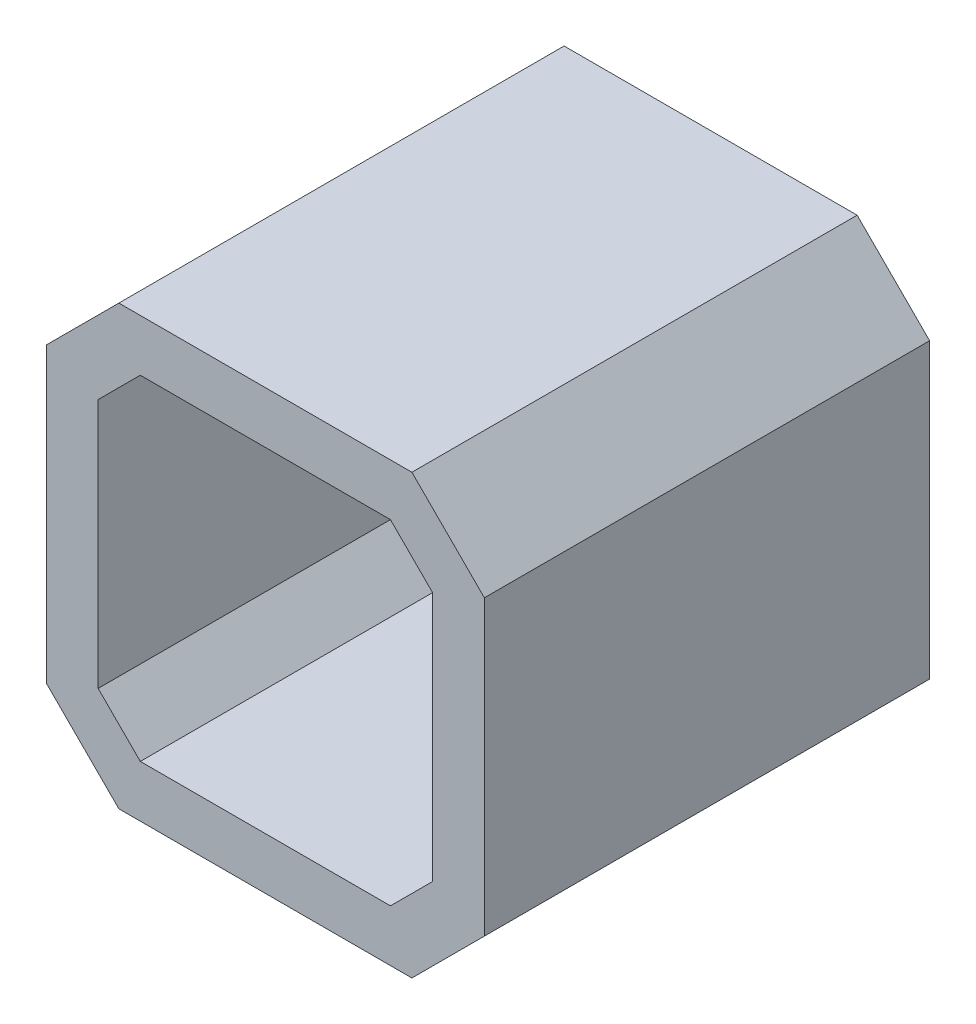
ISO-10303-21;
HEADER;
FILE_DESCRIPTION(('STEP AP214'),'2;1');
FILE_NAME('part.step','',(''),(''),'','','');
FILE_SCHEMA(('AUTOMOTIVE_DESIGN { 1 0 10303 214 1 1 1 1 }'));
ENDSEC;
DATA;
#1=APPLICATION_CONTEXT('core data for automotive mechanical design processes');
#2=APPLICATION_PROTOCOL_DEFINITION('international standard','automotive_design',2000,#1);
#3=PRODUCT_CONTEXT('',#1,'mechanical');
#4=PRODUCT('Part','Part','',(#3));
#5=PRODUCT_RELATED_PRODUCT_CATEGORY('part','',(#4));
#6=PRODUCT_DEFINITION_FORMATION('','',#4);
#7=PRODUCT_DEFINITION_CONTEXT('part definition',#1,'design');
#8=PRODUCT_DEFINITION('design','',#6,#7);
#9=PRODUCT_DEFINITION_SHAPE('','',#8);
#10=(LENGTH_UNIT() NAMED_UNIT(*) SI_UNIT(.MILLI.,.METRE.));
#11=(NAMED_UNIT(*) PLANE_ANGLE_UNIT() SI_UNIT($,.RADIAN.));
#12=(NAMED_UNIT(*) SI_UNIT($,.STERADIAN.) SOLID_ANGLE_UNIT());
#13=UNCERTAINTY_MEASURE_WITH_UNIT(LENGTH_MEASURE(1.E-05),#10,'distance_accuracy_value','');
#14=(GEOMETRIC_REPRESENTATION_CONTEXT(3) GLOBAL_UNCERTAINTY_ASSIGNED_CONTEXT((#13)) GLOBAL_UNIT_ASSIGNED_CONTEXT((#10,
#11,#12)) REPRESENTATION_CONTEXT('',''));
#15=CARTESIAN_POINT('',(0.,0.,0.));
#16=DIRECTION('',(0.,0.,1.));
#17=DIRECTION('',(1.,0.,0.));
#18=AXIS2_PLACEMENT_3D('',#15,#16,#17);
#19=CARTESIAN_POINT('',(0.,0.,43.));
#20=DIRECTION('',(0.,0.,-1.));
#21=DIRECTION('',(-1.,0.,0.));
#22=AXIS2_PLACEMENT_3D('',#19,#20,#21);
#23=PLANE('',#22);
#24=DIRECTION('',(0.,-1.,0.));
#25=VECTOR('',#24,1.);
#26=CARTESIAN_POINT('',(-21.15,-14.15,43.));
#27=LINE('',#26,#25);
#28=CARTESIAN_POINT('',(-21.15,14.15,43.));
#29=VERTEX_POINT('',#28);
#30=CARTESIAN_POINT('',(-21.15,-14.15,43.));
#31=VERTEX_POINT('',#30);
#32=EDGE_CURVE('E211',#29,#31,#27,.T.);
#33=ORIENTED_EDGE('',*,*,#32,.T.);
#34=DIRECTION('',(0.707106781186547,-0.707106781186547,0.));
#35=VECTOR('',#34,1.);
#36=CARTESIAN_POINT('',(-21.15,-14.15,43.));
#37=LINE('',#36,#35);
#38=CARTESIAN_POINT('',(-14.15,-21.15,43.));
#39=VERTEX_POINT('',#38);
#40=EDGE_CURVE('E214',#31,#39,#37,.T.);
#41=ORIENTED_EDGE('',*,*,#40,.T.);
#42=DIRECTION('',(1.,0.,0.));
#43=VECTOR('',#42,1.);
#44=CARTESIAN_POINT('',(-14.15,-21.15,43.));
#45=LINE('',#44,#43);
#46=CARTESIAN_POINT('',(14.15,-21.15,43.));
#47=VERTEX_POINT('',#46);
#48=EDGE_CURVE('E217',#39,#47,#45,.T.);
#49=ORIENTED_EDGE('',*,*,#48,.T.);
#50=DIRECTION('',(0.707106781186547,0.707106781186547,0.));
#51=VECTOR('',#50,1.);
#52=CARTESIAN_POINT('',(14.15,-21.15,43.));
#53=LINE('',#52,#51);
#54=CARTESIAN_POINT('',(21.15,-14.15,43.));
#55=VERTEX_POINT('',#54);
#56=EDGE_CURVE('E219',#47,#55,#53,.T.);
#57=ORIENTED_EDGE('',*,*,#56,.T.);
#58=DIRECTION('',(0.,1.,0.));
#59=VECTOR('',#58,1.);
#60=CARTESIAN_POINT('',(21.15,-14.15,43.));
#61=LINE('',#60,#59);
#62=CARTESIAN_POINT('',(21.15,14.15,43.));
#63=VERTEX_POINT('',#62);
#64=EDGE_CURVE('E221',#55,#63,#61,.T.);
#65=ORIENTED_EDGE('',*,*,#64,.T.);
#66=DIRECTION('',(-0.707106781186547,0.707106781186547,0.));
#67=VECTOR('',#66,1.);
#68=CARTESIAN_POINT('',(14.15,21.15,43.));
#69=LINE('',#68,#67);
#70=CARTESIAN_POINT('',(14.15,21.15,43.));
#71=VERTEX_POINT('',#70);
#72=EDGE_CURVE('E223',#63,#71,#69,.T.);
#73=ORIENTED_EDGE('',*,*,#72,.T.);
#74=DIRECTION('',(-1.,0.,0.));
#75=VECTOR('',#74,1.);
#76=CARTESIAN_POINT('',(-14.15,21.15,43.));
#77=LINE('',#76,#75);
#78=CARTESIAN_POINT('',(-14.15,21.15,43.));
#79=VERTEX_POINT('',#78);
#80=EDGE_CURVE('E225',#71,#79,#77,.T.);
#81=ORIENTED_EDGE('',*,*,#80,.T.);
#82=DIRECTION('',(-0.707106781186547,-0.707106781186547,0.));
#83=VECTOR('',#82,1.);
#84=CARTESIAN_POINT('',(-21.15,14.15,43.));
#85=LINE('',#84,#83);
#86=EDGE_CURVE('E227',#79,#29,#85,.T.);
#87=ORIENTED_EDGE('',*,*,#86,.T.);
#88=EDGE_LOOP('',(#33,#41,#49,#57,#65,#73,#81,#87));
#89=FACE_BOUND('',#88,.T.);
#90=DIRECTION('',(-0.707106781186547,-0.707106781186547,0.));
#91=VECTOR('',#90,1.);
#92=CARTESIAN_POINT('',(-16.15,12.0789321881345,43.));
#93=LINE('',#92,#91);
#94=CARTESIAN_POINT('',(-12.0789321881345,16.15,43.));
#95=VERTEX_POINT('',#94);
#96=CARTESIAN_POINT('',(-16.15,12.0789321881345,43.));
#97=VERTEX_POINT('',#96);
#98=EDGE_CURVE('E146',#95,#97,#93,.T.);
#99=ORIENTED_EDGE('',*,*,#98,.F.);
#100=DIRECTION('',(-1.,0.,0.));
#101=VECTOR('',#100,1.);
#102=CARTESIAN_POINT('',(-12.0789321881345,16.15,43.));
#103=LINE('',#102,#101);
#104=CARTESIAN_POINT('',(12.0789321881345,16.15,43.));
#105=VERTEX_POINT('',#104);
#106=EDGE_CURVE('E179',#105,#95,#103,.T.);
#107=ORIENTED_EDGE('',*,*,#106,.F.);
#108=DIRECTION('',(-0.707106781186547,0.707106781186547,0.));
#109=VECTOR('',#108,1.);
#110=CARTESIAN_POINT('',(12.0789321881345,16.15,43.));
#111=LINE('',#110,#109);
#112=CARTESIAN_POINT('',(16.15,12.0789321881345,43.));
#113=VERTEX_POINT('',#112);
#114=EDGE_CURVE('E177',#113,#105,#111,.T.);
#115=ORIENTED_EDGE('',*,*,#114,.F.);
#116=DIRECTION('',(0.,1.,0.));
#117=VECTOR('',#116,1.);
#118=CARTESIAN_POINT('',(16.15,-12.0789321881345,43.));
#119=LINE('',#118,#117);
#120=CARTESIAN_POINT('',(16.15,-12.0789321881345,43.));
#121=VERTEX_POINT('',#120);
#122=EDGE_CURVE('E175',#121,#113,#119,.T.);
#123=ORIENTED_EDGE('',*,*,#122,.F.);
#124=DIRECTION('',(0.707106781186547,0.707106781186547,0.));
#125=VECTOR('',#124,1.);
#126=CARTESIAN_POINT('',(12.0789321881345,-16.15,43.));
#127=LINE('',#126,#125);
#128=CARTESIAN_POINT('',(12.0789321881345,-16.15,43.));
#129=VERTEX_POINT('',#128);
#130=EDGE_CURVE('E173',#129,#121,#127,.T.);
#131=ORIENTED_EDGE('',*,*,#130,.F.);
#132=DIRECTION('',(1.,0.,0.));
#133=VECTOR('',#132,1.);
#134=CARTESIAN_POINT('',(-12.0789321881345,-16.15,43.));
#135=LINE('',#134,#133);
#136=CARTESIAN_POINT('',(-12.0789321881345,-16.15,43.));
#137=VERTEX_POINT('',#136);
#138=EDGE_CURVE('E169',#137,#129,#135,.T.);
#139=ORIENTED_EDGE('',*,*,#138,.F.);
#140=DIRECTION('',(0.707106781186547,-0.707106781186547,0.));
#141=VECTOR('',#140,1.);
#142=CARTESIAN_POINT('',(-16.15,-12.0789321881345,43.));
#143=LINE('',#142,#141);
#144=CARTESIAN_POINT('',(-16.15,-12.0789321881345,43.));
#145=VERTEX_POINT('',#144);
#146=EDGE_CURVE('E167',#145,#137,#143,.T.);
#147=ORIENTED_EDGE('',*,*,#146,.F.);
#148=DIRECTION('',(0.,-1.,0.));
#149=VECTOR('',#148,1.);
#150=CARTESIAN_POINT('',(-16.15,-12.0789321881345,43.));
#151=LINE('',#150,#149);
#152=EDGE_CURVE('E154',#97,#145,#151,.T.);
#153=ORIENTED_EDGE('',*,*,#152,.F.);
#154=EDGE_LOOP('',(#99,#107,#115,#123,#131,#139,#147,#153));
#155=FACE_BOUND('',#154,.T.);
#156=ADVANCED_FACE('F33',(#89,#155),#23,.F.);
#157=CARTESIAN_POINT('',(0.,0.,0.));
#158=DIRECTION('',(0.,0.,-1.));
#159=DIRECTION('',(-1.,0.,0.));
#160=AXIS2_PLACEMENT_3D('',#157,#158,#159);
#161=PLANE('',#160);
#162=DIRECTION('',(0.,-1.,0.));
#163=VECTOR('',#162,1.);
#164=CARTESIAN_POINT('',(-21.15,-14.15,0.));
#165=LINE('',#164,#163);
#166=CARTESIAN_POINT('',(-21.15,14.15,0.));
#167=VERTEX_POINT('',#166);
#168=CARTESIAN_POINT('',(-21.15,-14.15,0.));
#169=VERTEX_POINT('',#168);
#170=EDGE_CURVE('E162',#167,#169,#165,.T.);
#171=ORIENTED_EDGE('',*,*,#170,.F.);
#172=DIRECTION('',(-0.707106781186547,-0.707106781186547,0.));
#173=VECTOR('',#172,1.);
#174=CARTESIAN_POINT('',(-21.15,14.15,0.));
#175=LINE('',#174,#173);
#176=CARTESIAN_POINT('',(-14.15,21.15,0.));
#177=VERTEX_POINT('',#176);
#178=EDGE_CURVE('E215',#177,#167,#175,.T.);
#179=ORIENTED_EDGE('',*,*,#178,.F.);
#180=DIRECTION('',(-1.,0.,0.));
#181=VECTOR('',#180,1.);
#182=CARTESIAN_POINT('',(-14.15,21.15,0.));
#183=LINE('',#182,#181);
#184=CARTESIAN_POINT('',(14.15,21.15,0.));
#185=VERTEX_POINT('',#184);
#186=EDGE_CURVE('E242',#185,#177,#183,.T.);
#187=ORIENTED_EDGE('',*,*,#186,.F.);
#188=DIRECTION('',(-0.707106781186547,0.707106781186547,0.));
#189=VECTOR('',#188,1.);
#190=CARTESIAN_POINT('',(14.15,21.15,0.));
#191=LINE('',#190,#189);
#192=CARTESIAN_POINT('',(21.15,14.15,0.));
#193=VERTEX_POINT('',#192);
#194=EDGE_CURVE('E240',#193,#185,#191,.T.);
#195=ORIENTED_EDGE('',*,*,#194,.F.);
#196=DIRECTION('',(0.,1.,0.));
#197=VECTOR('',#196,1.);
#198=CARTESIAN_POINT('',(21.15,-14.15,0.));
#199=LINE('',#198,#197);
#200=CARTESIAN_POINT('',(21.15,-14.15,0.));
#201=VERTEX_POINT('',#200);
#202=EDGE_CURVE('E238',#201,#193,#199,.T.);
#203=ORIENTED_EDGE('',*,*,#202,.F.);
#204=DIRECTION('',(0.707106781186547,0.707106781186547,0.));
#205=VECTOR('',#204,1.);
#206=CARTESIAN_POINT('',(14.15,-21.15,0.));
#207=LINE('',#206,#205);
#208=CARTESIAN_POINT('',(14.15,-21.15,0.));
#209=VERTEX_POINT('',#208);
#210=EDGE_CURVE('E236',#209,#201,#207,.T.);
#211=ORIENTED_EDGE('',*,*,#210,.F.);
#212=DIRECTION('',(1.,0.,0.));
#213=VECTOR('',#212,1.);
#214=CARTESIAN_POINT('',(-14.15,-21.15,0.));
#215=LINE('',#214,#213);
#216=CARTESIAN_POINT('',(-14.15,-21.15,0.));
#217=VERTEX_POINT('',#216);
#218=EDGE_CURVE('E234',#217,#209,#215,.T.);
#219=ORIENTED_EDGE('',*,*,#218,.F.);
#220=DIRECTION('',(0.707106781186547,-0.707106781186547,0.));
#221=VECTOR('',#220,1.);
#222=CARTESIAN_POINT('',(-21.15,-14.15,0.));
#223=LINE('',#222,#221);
#224=EDGE_CURVE('E232',#169,#217,#223,.T.);
#225=ORIENTED_EDGE('',*,*,#224,.F.);
#226=EDGE_LOOP('',(#171,#179,#187,#195,#203,#211,#219,#225));
#227=FACE_BOUND('',#226,.T.);
#228=DIRECTION('',(-1.,0.,0.));
#229=VECTOR('',#228,1.);
#230=CARTESIAN_POINT('',(-12.0789321881345,16.15,0.));
#231=LINE('',#230,#229);
#232=CARTESIAN_POINT('',(12.0789321881345,16.15,0.));
#233=VERTEX_POINT('',#232);
#234=CARTESIAN_POINT('',(-12.0789321881345,16.15,0.));
#235=VERTEX_POINT('',#234);
#236=EDGE_CURVE('E155',#233,#235,#231,.T.);
#237=ORIENTED_EDGE('',*,*,#236,.T.);
#238=DIRECTION('',(-0.707106781186547,-0.707106781186547,0.));
#239=VECTOR('',#238,1.);
#240=CARTESIAN_POINT('',(-16.15,12.0789321881345,0.));
#241=LINE('',#240,#239);
#242=CARTESIAN_POINT('',(-16.15,12.0789321881345,0.));
#243=VERTEX_POINT('',#242);
#244=EDGE_CURVE('E56',#235,#243,#241,.T.);
#245=ORIENTED_EDGE('',*,*,#244,.T.);
#246=DIRECTION('',(0.,-1.,0.));
#247=VECTOR('',#246,1.);
#248=CARTESIAN_POINT('',(-16.15,-12.0789321881345,0.));
#249=LINE('',#248,#247);
#250=CARTESIAN_POINT('',(-16.15,-12.0789321881345,0.));
#251=VERTEX_POINT('',#250);
#252=EDGE_CURVE('E161',#243,#251,#249,.T.);
#253=ORIENTED_EDGE('',*,*,#252,.T.);
#254=DIRECTION('',(0.707106781186547,-0.707106781186547,0.));
#255=VECTOR('',#254,1.);
#256=CARTESIAN_POINT('',(-16.15,-12.0789321881345,0.));
#257=LINE('',#256,#255);
#258=CARTESIAN_POINT('',(-12.0789321881345,-16.15,0.));
#259=VERTEX_POINT('',#258);
#260=EDGE_CURVE('E183',#251,#259,#257,.T.);
#261=ORIENTED_EDGE('',*,*,#260,.T.);
#262=DIRECTION('',(1.,0.,0.));
#263=VECTOR('',#262,1.);
#264=CARTESIAN_POINT('',(-12.0789321881345,-16.15,0.));
#265=LINE('',#264,#263);
#266=CARTESIAN_POINT('',(12.0789321881345,-16.15,0.));
#267=VERTEX_POINT('',#266);
#268=EDGE_CURVE('E186',#259,#267,#265,.T.);
#269=ORIENTED_EDGE('',*,*,#268,.T.);
#270=DIRECTION('',(0.707106781186547,0.707106781186547,0.));
#271=VECTOR('',#270,1.);
#272=CARTESIAN_POINT('',(12.0789321881345,-16.15,0.));
#273=LINE('',#272,#271);
#274=CARTESIAN_POINT('',(16.15,-12.0789321881345,0.));
#275=VERTEX_POINT('',#274);
#276=EDGE_CURVE('E189',#267,#275,#273,.T.);
#277=ORIENTED_EDGE('',*,*,#276,.T.);
#278=DIRECTION('',(0.,1.,0.));
#279=VECTOR('',#278,1.);
#280=CARTESIAN_POINT('',(16.15,-12.0789321881345,0.));
#281=LINE('',#280,#279);
#282=CARTESIAN_POINT('',(16.15,12.0789321881345,0.));
#283=VERTEX_POINT('',#282);
#284=EDGE_CURVE('E192',#275,#283,#281,.T.);
#285=ORIENTED_EDGE('',*,*,#284,.T.);
#286=DIRECTION('',(-0.707106781186547,0.707106781186547,0.));
#287=VECTOR('',#286,1.);
#288=CARTESIAN_POINT('',(12.0789321881345,16.15,0.));
#289=LINE('',#288,#287);
#290=EDGE_CURVE('E195',#283,#233,#289,.T.);
#291=ORIENTED_EDGE('',*,*,#290,.T.);
#292=EDGE_LOOP('',(#237,#245,#253,#261,#269,#277,#285,#291));
#293=FACE_BOUND('',#292,.T.);
#294=ADVANCED_FACE('F272',(#227,#293),#161,.T.);
#295=CARTESIAN_POINT('',(-21.15,-14.15,43.));
#296=DIRECTION('',(1.,0.,0.));
#297=DIRECTION('',(0.,0.,-1.));
#298=AXIS2_PLACEMENT_3D('',#295,#296,#297);
#299=PLANE('',#298);
#300=ORIENTED_EDGE('',*,*,#170,.T.);
#301=DIRECTION('',(0.,0.,-1.));
#302=VECTOR('',#301,1.);
#303=CARTESIAN_POINT('',(-21.15,-14.15,43.));
#304=LINE('',#303,#302);
#305=EDGE_CURVE('E11',#31,#169,#304,.T.);
#306=ORIENTED_EDGE('',*,*,#305,.F.);
#307=ORIENTED_EDGE('',*,*,#32,.F.);
#308=DIRECTION('',(0.,0.,-1.));
#309=VECTOR('',#308,1.);
#310=CARTESIAN_POINT('',(-21.15,14.15,43.));
#311=LINE('',#310,#309);
#312=EDGE_CURVE('E229',#29,#167,#311,.T.);
#313=ORIENTED_EDGE('',*,*,#312,.T.);
#314=EDGE_LOOP('',(#300,#306,#307,#313));
#315=FACE_BOUND('',#314,.T.);
#316=ADVANCED_FACE('F35',(#315),#299,.F.);
#317=CARTESIAN_POINT('',(-21.15,-14.15,43.));
#318=DIRECTION('',(0.707106781186547,0.707106781186547,0.));
#319=DIRECTION('',(-0.707106781186548,0.707106781186548,0.));
#320=AXIS2_PLACEMENT_3D('',#317,#318,#319);
#321=PLANE('',#320);
#322=ORIENTED_EDGE('',*,*,#224,.T.);
#323=DIRECTION('',(0.,0.,-1.));
#324=VECTOR('',#323,1.);
#325=CARTESIAN_POINT('',(-14.15,-21.15,43.));
#326=LINE('',#325,#324);
#327=EDGE_CURVE('E41',#39,#217,#326,.T.);
#328=ORIENTED_EDGE('',*,*,#327,.F.);
#329=ORIENTED_EDGE('',*,*,#40,.F.);
#330=ORIENTED_EDGE('',*,*,#305,.T.);
#331=EDGE_LOOP('',(#322,#328,#329,#330));
#332=FACE_BOUND('',#331,.T.);
#333=ADVANCED_FACE('F289',(#332),#321,.F.);
#334=CARTESIAN_POINT('',(-14.15,-21.15,43.));
#335=DIRECTION('',(0.,1.,0.));
#336=DIRECTION('',(0.,0.,1.));
#337=AXIS2_PLACEMENT_3D('',#334,#335,#336);
#338=PLANE('',#337);
#339=ORIENTED_EDGE('',*,*,#218,.T.);
#340=DIRECTION('',(0.,0.,-1.));
#341=VECTOR('',#340,1.);
#342=CARTESIAN_POINT('',(14.15,-21.15,43.));
#343=LINE('',#342,#341);
#344=EDGE_CURVE('E259',#47,#209,#343,.T.);
#345=ORIENTED_EDGE('',*,*,#344,.F.);
#346=ORIENTED_EDGE('',*,*,#48,.F.);
#347=ORIENTED_EDGE('',*,*,#327,.T.);
#348=EDGE_LOOP('',(#339,#345,#346,#347));
#349=FACE_BOUND('',#348,.T.);
#350=ADVANCED_FACE('F266',(#349),#338,.F.);
#351=CARTESIAN_POINT('',(14.15,-21.15,43.));
#352=DIRECTION('',(-0.707106781186547,0.707106781186547,0.));
#353=DIRECTION('',(-0.707106781186548,-0.707106781186548,0.));
#354=AXIS2_PLACEMENT_3D('',#351,#352,#353);
#355=PLANE('',#354);
#356=ORIENTED_EDGE('',*,*,#210,.T.);
#357=DIRECTION('',(0.,0.,-1.));
#358=VECTOR('',#357,1.);
#359=CARTESIAN_POINT('',(21.15,-14.15,43.));
#360=LINE('',#359,#358);
#361=EDGE_CURVE('E256',#55,#201,#360,.T.);
#362=ORIENTED_EDGE('',*,*,#361,.F.);
#363=ORIENTED_EDGE('',*,*,#56,.F.);
#364=ORIENTED_EDGE('',*,*,#344,.T.);
#365=EDGE_LOOP('',(#356,#362,#363,#364));
#366=FACE_BOUND('',#365,.T.);
#367=ADVANCED_FACE('F278',(#366),#355,.F.);
#368=CARTESIAN_POINT('',(21.15,-14.15,43.));
#369=DIRECTION('',(-1.,0.,0.));
#370=DIRECTION('',(0.,0.,1.));
#371=AXIS2_PLACEMENT_3D('',#368,#369,#370);
#372=PLANE('',#371);
#373=ORIENTED_EDGE('',*,*,#202,.T.);
#374=DIRECTION('',(0.,0.,-1.));
#375=VECTOR('',#374,1.);
#376=CARTESIAN_POINT('',(21.15,14.15,43.));
#377=LINE('',#376,#375);
#378=EDGE_CURVE('E253',#63,#193,#377,.T.);
#379=ORIENTED_EDGE('',*,*,#378,.F.);
#380=ORIENTED_EDGE('',*,*,#64,.F.);
#381=ORIENTED_EDGE('',*,*,#361,.T.);
#382=EDGE_LOOP('',(#373,#379,#380,#381));
#383=FACE_BOUND('',#382,.T.);
#384=ADVANCED_FACE('F282',(#383),#372,.F.);
#385=CARTESIAN_POINT('',(14.15,21.15,43.));
#386=DIRECTION('',(-0.707106781186547,-0.707106781186547,0.));
#387=DIRECTION('',(0.707106781186548,-0.707106781186548,0.));
#388=AXIS2_PLACEMENT_3D('',#385,#386,#387);
#389=PLANE('',#388);
#390=ORIENTED_EDGE('',*,*,#194,.T.);
#391=DIRECTION('',(0.,0.,-1.));
#392=VECTOR('',#391,1.);
#393=CARTESIAN_POINT('',(14.15,21.15,43.));
#394=LINE('',#393,#392);
#395=EDGE_CURVE('E250',#71,#185,#394,.T.);
#396=ORIENTED_EDGE('',*,*,#395,.F.);
#397=ORIENTED_EDGE('',*,*,#72,.F.);
#398=ORIENTED_EDGE('',*,*,#378,.T.);
#399=EDGE_LOOP('',(#390,#396,#397,#398));
#400=FACE_BOUND('',#399,.T.);
#401=ADVANCED_FACE('F302',(#400),#389,.F.);
#402=CARTESIAN_POINT('',(-14.15,21.15,43.));
#403=DIRECTION('',(0.,-1.,0.));
#404=DIRECTION('',(0.,0.,-1.));
#405=AXIS2_PLACEMENT_3D('',#402,#403,#404);
#406=PLANE('',#405);
#407=ORIENTED_EDGE('',*,*,#186,.T.);
#408=DIRECTION('',(0.,0.,-1.));
#409=VECTOR('',#408,1.);
#410=CARTESIAN_POINT('',(-14.15,21.15,43.));
#411=LINE('',#410,#409);
#412=EDGE_CURVE('E247',#79,#177,#411,.T.);
#413=ORIENTED_EDGE('',*,*,#412,.F.);
#414=ORIENTED_EDGE('',*,*,#80,.F.);
#415=ORIENTED_EDGE('',*,*,#395,.T.);
#416=EDGE_LOOP('',(#407,#413,#414,#415));
#417=FACE_BOUND('',#416,.T.);
#418=ADVANCED_FACE('F300',(#417),#406,.F.);
#419=CARTESIAN_POINT('',(-21.15,14.15,43.));
#420=DIRECTION('',(0.707106781186547,-0.707106781186547,0.));
#421=DIRECTION('',(0.707106781186548,0.707106781186548,0.));
#422=AXIS2_PLACEMENT_3D('',#419,#420,#421);
#423=PLANE('',#422);
#424=ORIENTED_EDGE('',*,*,#178,.T.);
#425=ORIENTED_EDGE('',*,*,#312,.F.);
#426=ORIENTED_EDGE('',*,*,#86,.F.);
#427=ORIENTED_EDGE('',*,*,#412,.T.);
#428=EDGE_LOOP('',(#424,#425,#426,#427));
#429=FACE_BOUND('',#428,.T.);
#430=ADVANCED_FACE('F295',(#429),#423,.F.);
#431=CARTESIAN_POINT('',(-16.15,12.0789321881345,43.));
#432=DIRECTION('',(0.707106781186547,-0.707106781186547,0.));
#433=DIRECTION('',(0.707106781186548,0.707106781186548,0.));
#434=AXIS2_PLACEMENT_3D('',#431,#432,#433);
#435=PLANE('',#434);
#436=ORIENTED_EDGE('',*,*,#244,.F.);
#437=DIRECTION('',(0.,0.,-1.));
#438=VECTOR('',#437,1.);
#439=CARTESIAN_POINT('',(-12.0789321881345,16.15,43.));
#440=LINE('',#439,#438);
#441=EDGE_CURVE('E150',#95,#235,#440,.T.);
#442=ORIENTED_EDGE('',*,*,#441,.F.);
#443=ORIENTED_EDGE('',*,*,#98,.T.);
#444=DIRECTION('',(0.,0.,-1.));
#445=VECTOR('',#444,1.);
#446=CARTESIAN_POINT('',(-16.15,12.0789321881345,43.));
#447=LINE('',#446,#445);
#448=EDGE_CURVE('E149',#97,#243,#447,.T.);
#449=ORIENTED_EDGE('',*,*,#448,.T.);
#450=EDGE_LOOP('',(#436,#442,#443,#449));
#451=FACE_BOUND('',#450,.T.);
#452=ADVANCED_FACE('F148',(#451),#435,.T.);
#453=CARTESIAN_POINT('',(-16.15,-12.0789321881345,43.));
#454=DIRECTION('',(1.,0.,0.));
#455=DIRECTION('',(0.,0.,-1.));
#456=AXIS2_PLACEMENT_3D('',#453,#454,#455);
#457=PLANE('',#456);
#458=ORIENTED_EDGE('',*,*,#252,.F.);
#459=ORIENTED_EDGE('',*,*,#448,.F.);
#460=ORIENTED_EDGE('',*,*,#152,.T.);
#461=DIRECTION('',(0.,0.,-1.));
#462=VECTOR('',#461,1.);
#463=CARTESIAN_POINT('',(-16.15,-12.0789321881345,43.));
#464=LINE('',#463,#462);
#465=EDGE_CURVE('E163',#145,#251,#464,.T.);
#466=ORIENTED_EDGE('',*,*,#465,.T.);
#467=EDGE_LOOP('',(#458,#459,#460,#466));
#468=FACE_BOUND('',#467,.T.);
#469=ADVANCED_FACE('F158',(#468),#457,.T.);
#470=CARTESIAN_POINT('',(-16.15,-12.0789321881345,43.));
#471=DIRECTION('',(0.707106781186547,0.707106781186547,0.));
#472=DIRECTION('',(-0.707106781186548,0.707106781186548,0.));
#473=AXIS2_PLACEMENT_3D('',#470,#471,#472);
#474=PLANE('',#473);
#475=ORIENTED_EDGE('',*,*,#260,.F.);
#476=ORIENTED_EDGE('',*,*,#465,.F.);
#477=ORIENTED_EDGE('',*,*,#146,.T.);
#478=DIRECTION('',(0.,0.,-1.));
#479=VECTOR('',#478,1.);
#480=CARTESIAN_POINT('',(-12.0789321881345,-16.15,43.));
#481=LINE('',#480,#479);
#482=EDGE_CURVE('E208',#137,#259,#481,.T.);
#483=ORIENTED_EDGE('',*,*,#482,.T.);
#484=EDGE_LOOP('',(#475,#476,#477,#483));
#485=FACE_BOUND('',#484,.T.);
#486=ADVANCED_FACE('F327',(#485),#474,.T.);
#487=CARTESIAN_POINT('',(-12.0789321881345,-16.15,43.));
#488=DIRECTION('',(0.,1.,0.));
#489=DIRECTION('',(0.,0.,1.));
#490=AXIS2_PLACEMENT_3D('',#487,#488,#489);
#491=PLANE('',#490);
#492=ORIENTED_EDGE('',*,*,#268,.F.);
#493=ORIENTED_EDGE('',*,*,#482,.F.);
#494=ORIENTED_EDGE('',*,*,#138,.T.);
#495=DIRECTION('',(0.,0.,-1.));
#496=VECTOR('',#495,1.);
#497=CARTESIAN_POINT('',(12.0789321881345,-16.15,43.));
#498=LINE('',#497,#496);
#499=EDGE_CURVE('E206',#129,#267,#498,.T.);
#500=ORIENTED_EDGE('',*,*,#499,.T.);
#501=EDGE_LOOP('',(#492,#493,#494,#500));
#502=FACE_BOUND('',#501,.T.);
#503=ADVANCED_FACE('F331',(#502),#491,.T.);
#504=CARTESIAN_POINT('',(12.0789321881345,-16.15,43.));
#505=DIRECTION('',(-0.707106781186547,0.707106781186547,0.));
#506=DIRECTION('',(-0.707106781186548,-0.707106781186548,0.));
#507=AXIS2_PLACEMENT_3D('',#504,#505,#506);
#508=PLANE('',#507);
#509=ORIENTED_EDGE('',*,*,#276,.F.);
#510=ORIENTED_EDGE('',*,*,#499,.F.);
#511=ORIENTED_EDGE('',*,*,#130,.T.);
#512=DIRECTION('',(0.,0.,-1.));
#513=VECTOR('',#512,1.);
#514=CARTESIAN_POINT('',(16.15,-12.0789321881345,43.));
#515=LINE('',#514,#513);
#516=EDGE_CURVE('E204',#121,#275,#515,.T.);
#517=ORIENTED_EDGE('',*,*,#516,.T.);
#518=EDGE_LOOP('',(#509,#510,#511,#517));
#519=FACE_BOUND('',#518,.T.);
#520=ADVANCED_FACE('F337',(#519),#508,.T.);
#521=CARTESIAN_POINT('',(16.15,-12.0789321881345,43.));
#522=DIRECTION('',(-1.,0.,0.));
#523=DIRECTION('',(0.,0.,1.));
#524=AXIS2_PLACEMENT_3D('',#521,#522,#523);
#525=PLANE('',#524);
#526=ORIENTED_EDGE('',*,*,#284,.F.);
#527=ORIENTED_EDGE('',*,*,#516,.F.);
#528=ORIENTED_EDGE('',*,*,#122,.T.);
#529=DIRECTION('',(0.,0.,-1.));
#530=VECTOR('',#529,1.);
#531=CARTESIAN_POINT('',(16.15,12.0789321881345,43.));
#532=LINE('',#531,#530);
#533=EDGE_CURVE('E202',#113,#283,#532,.T.);
#534=ORIENTED_EDGE('',*,*,#533,.T.);
#535=EDGE_LOOP('',(#526,#527,#528,#534));
#536=FACE_BOUND('',#535,.T.);
#537=ADVANCED_FACE('F341',(#536),#525,.T.);
#538=CARTESIAN_POINT('',(12.0789321881345,16.15,43.));
#539=DIRECTION('',(-0.707106781186547,-0.707106781186547,0.));
#540=DIRECTION('',(0.707106781186548,-0.707106781186548,0.));
#541=AXIS2_PLACEMENT_3D('',#538,#539,#540);
#542=PLANE('',#541);
#543=ORIENTED_EDGE('',*,*,#290,.F.);
#544=ORIENTED_EDGE('',*,*,#533,.F.);
#545=ORIENTED_EDGE('',*,*,#114,.T.);
#546=DIRECTION('',(0.,0.,-1.));
#547=VECTOR('',#546,1.);
#548=CARTESIAN_POINT('',(12.0789321881345,16.15,43.));
#549=LINE('',#548,#547);
#550=EDGE_CURVE('E48',#105,#233,#549,.T.);
#551=ORIENTED_EDGE('',*,*,#550,.T.);
#552=EDGE_LOOP('',(#543,#544,#545,#551));
#553=FACE_BOUND('',#552,.T.);
#554=ADVANCED_FACE('F345',(#553),#542,.T.);
#555=CARTESIAN_POINT('',(-12.0789321881345,16.15,43.));
#556=DIRECTION('',(0.,-1.,0.));
#557=DIRECTION('',(0.,0.,-1.));
#558=AXIS2_PLACEMENT_3D('',#555,#556,#557);
#559=PLANE('',#558);
#560=ORIENTED_EDGE('',*,*,#236,.F.);
#561=ORIENTED_EDGE('',*,*,#550,.F.);
#562=ORIENTED_EDGE('',*,*,#106,.T.);
#563=ORIENTED_EDGE('',*,*,#441,.T.);
#564=EDGE_LOOP('',(#560,#561,#562,#563));
#565=FACE_BOUND('',#564,.T.);
#566=ADVANCED_FACE('F349',(#565),#559,.T.);
#567=CLOSED_SHELL('',(#156,#294,#316,#333,#350,#367,#384,#401,#418,#430,#452,#469,#486,#503,
#520,#537,#554,#566));
#568=MANIFOLD_SOLID_BREP('B2',#567);
#569=ADVANCED_BREP_SHAPE_REPRESENTATION('',(#18,#568),#14);
#570=SHAPE_DEFINITION_REPRESENTATION(#9,#569);
ENDSEC;
END-ISO-10303-21;
